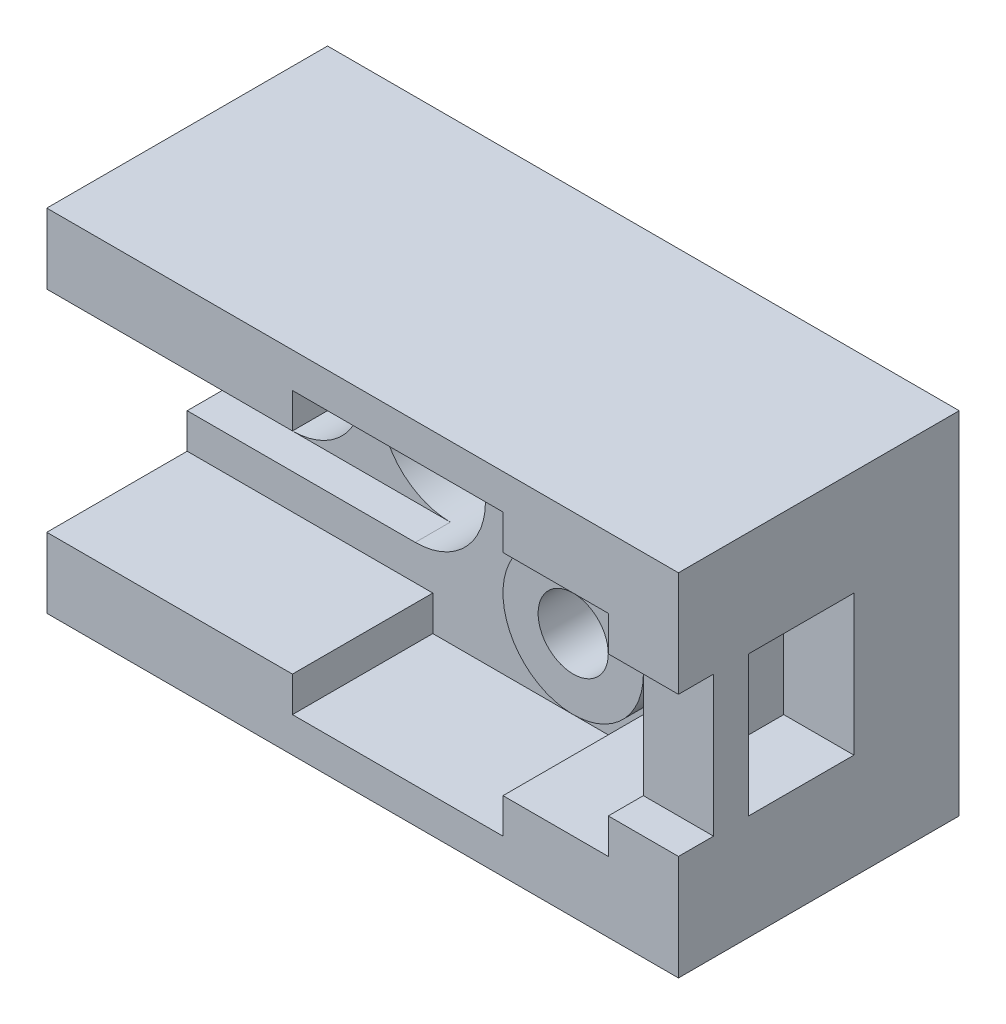
ISO-10303-21;
HEADER;
FILE_DESCRIPTION(('STEP AP214'),'2;1');
FILE_NAME('part.step','',(''),(''),'','','');
FILE_SCHEMA(('AUTOMOTIVE_DESIGN { 1 0 10303 214 1 1 1 1 }'));
ENDSEC;
DATA;
#1=APPLICATION_CONTEXT('core data for automotive mechanical design processes');
#2=APPLICATION_PROTOCOL_DEFINITION('international standard','automotive_design',2000,#1);
#3=PRODUCT_CONTEXT('',#1,'mechanical');
#4=PRODUCT('Part','Part','',(#3));
#5=PRODUCT_RELATED_PRODUCT_CATEGORY('part','',(#4));
#6=PRODUCT_DEFINITION_FORMATION('','',#4);
#7=PRODUCT_DEFINITION_CONTEXT('part definition',#1,'design');
#8=PRODUCT_DEFINITION('design','',#6,#7);
#9=PRODUCT_DEFINITION_SHAPE('','',#8);
#10=(LENGTH_UNIT() NAMED_UNIT(*) SI_UNIT(.MILLI.,.METRE.));
#11=(NAMED_UNIT(*) PLANE_ANGLE_UNIT() SI_UNIT($,.RADIAN.));
#12=(NAMED_UNIT(*) SI_UNIT($,.STERADIAN.) SOLID_ANGLE_UNIT());
#13=UNCERTAINTY_MEASURE_WITH_UNIT(LENGTH_MEASURE(1.E-05),#10,'distance_accuracy_value','');
#14=(GEOMETRIC_REPRESENTATION_CONTEXT(3) GLOBAL_UNCERTAINTY_ASSIGNED_CONTEXT((#13)) GLOBAL_UNIT_ASSIGNED_CONTEXT((#10,
#11,#12)) REPRESENTATION_CONTEXT('',''));
#15=CARTESIAN_POINT('',(0.,0.,0.));
#16=DIRECTION('',(0.,0.,1.));
#17=DIRECTION('',(1.,0.,0.));
#18=AXIS2_PLACEMENT_3D('',#15,#16,#17);
#19=CARTESIAN_POINT('',(0.,30.,0.));
#20=DIRECTION('',(0.,-1.,0.));
#21=DIRECTION('',(0.,0.,-1.));
#22=AXIS2_PLACEMENT_3D('',#19,#20,#21);
#23=PLANE('',#22);
#24=DIRECTION('',(0.,0.,-1.));
#25=VECTOR('',#24,1.);
#26=CARTESIAN_POINT('',(180.,30.,80.));
#27=LINE('',#26,#25);
#28=CARTESIAN_POINT('',(180.,30.,80.));
#29=VERTEX_POINT('',#28);
#30=CARTESIAN_POINT('',(180.,30.,70.));
#31=VERTEX_POINT('',#30);
#32=EDGE_CURVE('E56',#29,#31,#27,.T.);
#33=ORIENTED_EDGE('',*,*,#32,.T.);
#34=DIRECTION('',(-1.,0.,0.));
#35=VECTOR('',#34,1.);
#36=CARTESIAN_POINT('',(180.,30.,70.));
#37=LINE('',#36,#35);
#38=CARTESIAN_POINT('',(160.,30.,70.));
#39=VERTEX_POINT('',#38);
#40=EDGE_CURVE('E390',#31,#39,#37,.T.);
#41=ORIENTED_EDGE('',*,*,#40,.T.);
#42=DIRECTION('',(0.,0.,1.));
#43=VECTOR('',#42,1.);
#44=CARTESIAN_POINT('',(160.,30.,70.));
#45=LINE('',#44,#43);
#46=CARTESIAN_POINT('',(160.,30.,80.));
#47=VERTEX_POINT('',#46);
#48=EDGE_CURVE('E489',#39,#47,#45,.T.);
#49=ORIENTED_EDGE('',*,*,#48,.T.);
#50=DIRECTION('',(1.,0.,0.));
#51=VECTOR('',#50,1.);
#52=CARTESIAN_POINT('',(0.,30.,80.));
#53=LINE('',#52,#51);
#54=EDGE_CURVE('E293',#47,#29,#53,.T.);
#55=ORIENTED_EDGE('',*,*,#54,.T.);
#56=EDGE_LOOP('',(#33,#41,#49,#55));
#57=FACE_BOUND('',#56,.T.);
#58=ADVANCED_FACE('F33',(#57),#23,.F.);
#59=CARTESIAN_POINT('',(0.,70.,0.));
#60=DIRECTION('',(0.,1.,0.));
#61=DIRECTION('',(0.,0.,1.));
#62=AXIS2_PLACEMENT_3D('',#59,#60,#61);
#63=PLANE('',#62);
#64=DIRECTION('',(0.,0.,1.));
#65=VECTOR('',#64,1.);
#66=CARTESIAN_POINT('',(160.,70.,70.));
#67=LINE('',#66,#65);
#68=CARTESIAN_POINT('',(160.,70.,70.));
#69=VERTEX_POINT('',#68);
#70=CARTESIAN_POINT('',(160.,70.,80.));
#71=VERTEX_POINT('',#70);
#72=EDGE_CURVE('E386',#69,#71,#67,.T.);
#73=ORIENTED_EDGE('',*,*,#72,.F.);
#74=DIRECTION('',(-1.,0.,0.));
#75=VECTOR('',#74,1.);
#76=CARTESIAN_POINT('',(180.,70.,70.));
#77=LINE('',#76,#75);
#78=CARTESIAN_POINT('',(180.,70.,70.));
#79=VERTEX_POINT('',#78);
#80=EDGE_CURVE('E385',#79,#69,#77,.T.);
#81=ORIENTED_EDGE('',*,*,#80,.F.);
#82=DIRECTION('',(0.,0.,1.));
#83=VECTOR('',#82,1.);
#84=CARTESIAN_POINT('',(180.,70.,80.));
#85=LINE('',#84,#83);
#86=CARTESIAN_POINT('',(180.,70.,80.));
#87=VERTEX_POINT('',#86);
#88=EDGE_CURVE('E262',#79,#87,#85,.T.);
#89=ORIENTED_EDGE('',*,*,#88,.T.);
#90=DIRECTION('',(-1.,0.,0.));
#91=VECTOR('',#90,1.);
#92=CARTESIAN_POINT('',(0.,70.,80.));
#93=LINE('',#92,#91);
#94=EDGE_CURVE('E298',#87,#71,#93,.T.);
#95=ORIENTED_EDGE('',*,*,#94,.T.);
#96=EDGE_LOOP('',(#73,#81,#89,#95));
#97=FACE_BOUND('',#96,.T.);
#98=ADVANCED_FACE('F383',(#97),#63,.F.);
#99=DIRECTION('',(-1.,0.,0.));
#100=VECTOR('',#99,1.);
#101=CARTESIAN_POINT('',(0.,30.,40.));
#102=LINE('',#101,#100);
#103=CARTESIAN_POINT('',(65.,30.,40.));
#104=VERTEX_POINT('',#103);
#105=CARTESIAN_POINT('',(0.,30.,40.));
#106=VERTEX_POINT('',#105);
#107=EDGE_CURVE('E440',#104,#106,#102,.T.);
#108=ORIENTED_EDGE('',*,*,#107,.F.);
#109=DIRECTION('',(0.,0.,1.));
#110=VECTOR('',#109,1.);
#111=CARTESIAN_POINT('',(65.,30.,30.));
#112=LINE('',#111,#110);
#113=CARTESIAN_POINT('',(65.,30.,30.));
#114=VERTEX_POINT('',#113);
#115=EDGE_CURVE('E275',#114,#104,#112,.T.);
#116=ORIENTED_EDGE('',*,*,#115,.F.);
#117=DIRECTION('',(1.,0.,0.));
#118=VECTOR('',#117,1.);
#119=CARTESIAN_POINT('',(20.,30.,30.));
#120=LINE('',#119,#118);
#121=CARTESIAN_POINT('',(20.,30.,30.));
#122=VERTEX_POINT('',#121);
#123=EDGE_CURVE('E265',#122,#114,#120,.T.);
#124=ORIENTED_EDGE('',*,*,#123,.F.);
#125=DIRECTION('',(0.,0.,1.));
#126=VECTOR('',#125,1.);
#127=CARTESIAN_POINT('',(20.,30.,0.));
#128=LINE('',#127,#126);
#129=CARTESIAN_POINT('',(20.,30.,0.));
#130=VERTEX_POINT('',#129);
#131=EDGE_CURVE('E315',#130,#122,#128,.T.);
#132=ORIENTED_EDGE('',*,*,#131,.F.);
#133=DIRECTION('',(1.,0.,0.));
#134=VECTOR('',#133,1.);
#135=CARTESIAN_POINT('',(0.,30.,0.));
#136=LINE('',#135,#134);
#137=CARTESIAN_POINT('',(0.,30.,0.));
#138=VERTEX_POINT('',#137);
#139=EDGE_CURVE('E294',#138,#130,#136,.T.);
#140=ORIENTED_EDGE('',*,*,#139,.F.);
#141=DIRECTION('',(0.,0.,1.));
#142=VECTOR('',#141,1.);
#143=CARTESIAN_POINT('',(0.,30.,0.));
#144=LINE('',#143,#142);
#145=EDGE_CURVE('E304',#138,#106,#144,.T.);
#146=ORIENTED_EDGE('',*,*,#145,.T.);
#147=EDGE_LOOP('',(#108,#116,#124,#132,#140,#146));
#148=FACE_BOUND('',#147,.T.);
#149=ADVANCED_FACE('F561',(#148),#23,.F.);
#150=DIRECTION('',(1.,0.,0.));
#151=VECTOR('',#150,1.);
#152=CARTESIAN_POINT('',(0.,70.,40.));
#153=LINE('',#152,#151);
#154=CARTESIAN_POINT('',(0.,70.,40.));
#155=VERTEX_POINT('',#154);
#156=CARTESIAN_POINT('',(65.,70.,40.));
#157=VERTEX_POINT('',#156);
#158=EDGE_CURVE('E436',#155,#157,#153,.T.);
#159=ORIENTED_EDGE('',*,*,#158,.F.);
#160=DIRECTION('',(0.,0.,1.));
#161=VECTOR('',#160,1.);
#162=CARTESIAN_POINT('',(0.,70.,0.));
#163=LINE('',#162,#161);
#164=CARTESIAN_POINT('',(0.,70.,0.));
#165=VERTEX_POINT('',#164);
#166=EDGE_CURVE('E308',#165,#155,#163,.T.);
#167=ORIENTED_EDGE('',*,*,#166,.F.);
#168=DIRECTION('',(-1.,0.,0.));
#169=VECTOR('',#168,1.);
#170=CARTESIAN_POINT('',(0.,70.,0.));
#171=LINE('',#170,#169);
#172=CARTESIAN_POINT('',(20.,70.,0.));
#173=VERTEX_POINT('',#172);
#174=EDGE_CURVE('E301',#173,#165,#171,.T.);
#175=ORIENTED_EDGE('',*,*,#174,.F.);
#176=DIRECTION('',(0.,0.,1.));
#177=VECTOR('',#176,1.);
#178=CARTESIAN_POINT('',(20.,70.,0.));
#179=LINE('',#178,#177);
#180=CARTESIAN_POINT('',(19.9999999999999,70.,30.));
#181=VERTEX_POINT('',#180);
#182=EDGE_CURVE('E312',#173,#181,#179,.T.);
#183=ORIENTED_EDGE('',*,*,#182,.T.);
#184=DIRECTION('',(-1.,0.,0.));
#185=VECTOR('',#184,1.);
#186=CARTESIAN_POINT('',(19.9999999999999,70.,30.));
#187=LINE('',#186,#185);
#188=CARTESIAN_POINT('',(65.,70.,30.));
#189=VERTEX_POINT('',#188);
#190=EDGE_CURVE('E273',#189,#181,#187,.T.);
#191=ORIENTED_EDGE('',*,*,#190,.F.);
#192=DIRECTION('',(0.,0.,1.));
#193=VECTOR('',#192,1.);
#194=CARTESIAN_POINT('',(65.,70.,30.));
#195=LINE('',#194,#193);
#196=EDGE_CURVE('E276',#189,#157,#195,.T.);
#197=ORIENTED_EDGE('',*,*,#196,.T.);
#198=EDGE_LOOP('',(#159,#167,#175,#183,#191,#197));
#199=FACE_BOUND('',#198,.T.);
#200=ADVANCED_FACE('F570',(#199),#63,.F.);
#201=CARTESIAN_POINT('',(65.,50.,20.));
#202=DIRECTION('',(0.,0.,1.));
#203=DIRECTION('',(1.,0.,0.));
#204=AXIS2_PLACEMENT_3D('',#201,#202,#203);
#205=CYLINDRICAL_SURFACE('',#204,20.);
#206=CARTESIAN_POINT('',(65.,50.,20.));
#207=DIRECTION('',(0.,0.,1.));
#208=DIRECTION('',(1.,0.,0.));
#209=AXIS2_PLACEMENT_3D('',#206,#207,#208);
#210=CIRCLE('',#209,20.);
#211=CARTESIAN_POINT('',(85.,50.,20.));
#212=VERTEX_POINT('',#211);
#213=EDGE_CURVE('E279',#212,#212,#210,.T.);
#214=ORIENTED_EDGE('',*,*,#213,.F.);
#215=EDGE_LOOP('',(#214));
#216=FACE_BOUND('',#215,.T.);
#217=CARTESIAN_POINT('',(65.,50.,40.));
#218=DIRECTION('',(0.,0.,1.));
#219=DIRECTION('',(1.,0.,0.));
#220=AXIS2_PLACEMENT_3D('',#217,#218,#219);
#221=CIRCLE('',#220,20.);
#222=EDGE_CURVE('E438',#157,#104,#221,.F.);
#223=ORIENTED_EDGE('',*,*,#222,.F.);
#224=ORIENTED_EDGE('',*,*,#196,.F.);
#225=CARTESIAN_POINT('',(65.,50.,30.));
#226=DIRECTION('',(0.,0.,-1.));
#227=DIRECTION('',(1.,0.,0.));
#228=AXIS2_PLACEMENT_3D('',#225,#226,#227);
#229=CIRCLE('',#228,20.);
#230=EDGE_CURVE('E271',#114,#189,#229,.T.);
#231=ORIENTED_EDGE('',*,*,#230,.F.);
#232=ORIENTED_EDGE('',*,*,#115,.T.);
#233=EDGE_LOOP('',(#223,#224,#231,#232));
#234=FACE_BOUND('',#233,.T.);
#235=ADVANCED_FACE('F668',(#216,#234),#205,.F.);
#236=CARTESIAN_POINT('',(0.,0.,80.));
#237=DIRECTION('',(1.,0.,0.));
#238=DIRECTION('',(0.,0.,-1.));
#239=AXIS2_PLACEMENT_3D('',#236,#237,#238);
#240=PLANE('',#239);
#241=DIRECTION('',(0.,0.,1.));
#242=VECTOR('',#241,1.);
#243=CARTESIAN_POINT('',(0.,20.,70.));
#244=LINE('',#243,#242);
#245=CARTESIAN_POINT('',(0.,20.,40.));
#246=VERTEX_POINT('',#245);
#247=CARTESIAN_POINT('',(0.,20.,80.));
#248=VERTEX_POINT('',#247);
#249=EDGE_CURVE('E485',#246,#248,#244,.T.);
#250=ORIENTED_EDGE('',*,*,#249,.F.);
#251=DIRECTION('',(0.,-1.,0.));
#252=VECTOR('',#251,1.);
#253=CARTESIAN_POINT('',(0.,0.,40.));
#254=LINE('',#253,#252);
#255=EDGE_CURVE('E442',#106,#246,#254,.T.);
#256=ORIENTED_EDGE('',*,*,#255,.F.);
#257=ORIENTED_EDGE('',*,*,#145,.F.);
#258=DIRECTION('',(0.,-1.,0.));
#259=VECTOR('',#258,1.);
#260=CARTESIAN_POINT('',(0.,0.,0.));
#261=LINE('',#260,#259);
#262=CARTESIAN_POINT('',(0.,0.,0.));
#263=VERTEX_POINT('',#262);
#264=EDGE_CURVE('E311',#138,#263,#261,.T.);
#265=ORIENTED_EDGE('',*,*,#264,.T.);
#266=DIRECTION('',(0.,0.,-1.));
#267=VECTOR('',#266,1.);
#268=CARTESIAN_POINT('',(0.,0.,80.));
#269=LINE('',#268,#267);
#270=CARTESIAN_POINT('',(0.,0.,80.));
#271=VERTEX_POINT('',#270);
#272=EDGE_CURVE('E11',#271,#263,#269,.T.);
#273=ORIENTED_EDGE('',*,*,#272,.F.);
#274=DIRECTION('',(0.,-1.,0.));
#275=VECTOR('',#274,1.);
#276=CARTESIAN_POINT('',(0.,0.,80.));
#277=LINE('',#276,#275);
#278=EDGE_CURVE('E324',#248,#271,#277,.T.);
#279=ORIENTED_EDGE('',*,*,#278,.F.);
#280=EDGE_LOOP('',(#250,#256,#257,#265,#273,#279));
#281=FACE_BOUND('',#280,.T.);
#282=ADVANCED_FACE('F35',(#281),#240,.F.);
#283=CARTESIAN_POINT('',(0.,0.,80.));
#284=DIRECTION('',(0.,0.,-1.));
#285=DIRECTION('',(-1.,0.,0.));
#286=AXIS2_PLACEMENT_3D('',#283,#284,#285);
#287=PLANE('',#286);
#288=DIRECTION('',(-1.,0.,0.));
#289=VECTOR('',#288,1.);
#290=CARTESIAN_POINT('',(0.,20.,80.));
#291=LINE('',#290,#289);
#292=CARTESIAN_POINT('',(70.,20.,80.));
#293=VERTEX_POINT('',#292);
#294=EDGE_CURVE('E466',#293,#248,#291,.T.);
#295=ORIENTED_EDGE('',*,*,#294,.T.);
#296=ORIENTED_EDGE('',*,*,#278,.T.);
#297=DIRECTION('',(1.,0.,0.));
#298=VECTOR('',#297,1.);
#299=CARTESIAN_POINT('',(0.,0.,80.));
#300=LINE('',#299,#298);
#301=CARTESIAN_POINT('',(180.,0.,80.));
#302=VERTEX_POINT('',#301);
#303=EDGE_CURVE('E323',#271,#302,#300,.T.);
#304=ORIENTED_EDGE('',*,*,#303,.T.);
#305=DIRECTION('',(0.,1.,0.));
#306=VECTOR('',#305,1.);
#307=CARTESIAN_POINT('',(180.,0.,80.));
#308=LINE('',#307,#306);
#309=EDGE_CURVE('E327',#302,#29,#308,.T.);
#310=ORIENTED_EDGE('',*,*,#309,.T.);
#311=ORIENTED_EDGE('',*,*,#54,.F.);
#312=DIRECTION('',(0.,-1.,0.));
#313=VECTOR('',#312,1.);
#314=CARTESIAN_POINT('',(160.,0.,80.));
#315=LINE('',#314,#313);
#316=CARTESIAN_POINT('',(160.,20.,80.));
#317=VERTEX_POINT('',#316);
#318=EDGE_CURVE('E481',#47,#317,#315,.T.);
#319=ORIENTED_EDGE('',*,*,#318,.T.);
#320=DIRECTION('',(-1.,0.,0.));
#321=VECTOR('',#320,1.);
#322=CARTESIAN_POINT('',(0.,20.,80.));
#323=LINE('',#322,#321);
#324=CARTESIAN_POINT('',(130.,20.,80.));
#325=VERTEX_POINT('',#324);
#326=EDGE_CURVE('E478',#317,#325,#323,.T.);
#327=ORIENTED_EDGE('',*,*,#326,.T.);
#328=DIRECTION('',(0.,-1.,0.));
#329=VECTOR('',#328,1.);
#330=CARTESIAN_POINT('',(130.,0.,80.));
#331=LINE('',#330,#329);
#332=CARTESIAN_POINT('',(130.,10.,80.));
#333=VERTEX_POINT('',#332);
#334=EDGE_CURVE('E475',#325,#333,#331,.T.);
#335=ORIENTED_EDGE('',*,*,#334,.T.);
#336=DIRECTION('',(-1.,0.,0.));
#337=VECTOR('',#336,1.);
#338=CARTESIAN_POINT('',(0.,9.99999999999999,80.));
#339=LINE('',#338,#337);
#340=CARTESIAN_POINT('',(70.,10.,80.));
#341=VERTEX_POINT('',#340);
#342=EDGE_CURVE('E472',#333,#341,#339,.T.);
#343=ORIENTED_EDGE('',*,*,#342,.T.);
#344=DIRECTION('',(0.,1.,0.));
#345=VECTOR('',#344,1.);
#346=CARTESIAN_POINT('',(70.,0.,80.));
#347=LINE('',#346,#345);
#348=EDGE_CURVE('E469',#341,#293,#347,.T.);
#349=ORIENTED_EDGE('',*,*,#348,.T.);
#350=EDGE_LOOP('',(#295,#296,#304,#310,#311,#319,#327,#335,#343,#349));
#351=FACE_BOUND('',#350,.T.);
#352=ADVANCED_FACE('F551',(#351),#287,.F.);
#353=CARTESIAN_POINT('',(160.,30.,40.));
#354=VERTEX_POINT('',#353);
#355=CARTESIAN_POINT('',(160.,30.,60.));
#356=VERTEX_POINT('',#355);
#357=EDGE_CURVE('E487',#354,#356,#45,.T.);
#358=ORIENTED_EDGE('',*,*,#357,.T.);
#359=DIRECTION('',(-1.,0.,0.));
#360=VECTOR('',#359,1.);
#361=CARTESIAN_POINT('',(180.,30.,60.));
#362=LINE('',#361,#360);
#363=CARTESIAN_POINT('',(180.,30.,60.));
#364=VERTEX_POINT('',#363);
#365=EDGE_CURVE('E48',#364,#356,#362,.T.);
#366=ORIENTED_EDGE('',*,*,#365,.F.);
#367=CARTESIAN_POINT('',(180.,30.,30.));
#368=VERTEX_POINT('',#367);
#369=EDGE_CURVE('E254',#364,#368,#27,.T.);
#370=ORIENTED_EDGE('',*,*,#369,.T.);
#371=DIRECTION('',(1.,0.,0.));
#372=VECTOR('',#371,1.);
#373=CARTESIAN_POINT('',(180.,30.,30.));
#374=LINE('',#373,#372);
#375=CARTESIAN_POINT('',(160.,30.,30.));
#376=VERTEX_POINT('',#375);
#377=EDGE_CURVE('E405',#376,#368,#374,.T.);
#378=ORIENTED_EDGE('',*,*,#377,.F.);
#379=DIRECTION('',(0.,0.,1.));
#380=VECTOR('',#379,1.);
#381=CARTESIAN_POINT('',(160.,30.,30.));
#382=LINE('',#381,#380);
#383=EDGE_CURVE('E409',#376,#354,#382,.T.);
#384=ORIENTED_EDGE('',*,*,#383,.T.);
#385=EDGE_LOOP('',(#358,#366,#370,#378,#384));
#386=FACE_BOUND('',#385,.T.);
#387=ADVANCED_FACE('F593',(#386),#23,.F.);
#388=DIRECTION('',(1.,0.,0.));
#389=VECTOR('',#388,1.);
#390=CARTESIAN_POINT('',(0.,80.,80.));
#391=LINE('',#390,#389);
#392=CARTESIAN_POINT('',(0.,80.,80.));
#393=VERTEX_POINT('',#392);
#394=CARTESIAN_POINT('',(70.,80.,80.));
#395=VERTEX_POINT('',#394);
#396=EDGE_CURVE('E375',#393,#395,#391,.T.);
#397=ORIENTED_EDGE('',*,*,#396,.T.);
#398=DIRECTION('',(0.,-1.,0.));
#399=VECTOR('',#398,1.);
#400=CARTESIAN_POINT('',(70.,0.,80.));
#401=LINE('',#400,#399);
#402=CARTESIAN_POINT('',(70.,90.,80.));
#403=VERTEX_POINT('',#402);
#404=EDGE_CURVE('E512',#403,#395,#401,.T.);
#405=ORIENTED_EDGE('',*,*,#404,.F.);
#406=DIRECTION('',(-1.,0.,0.));
#407=VECTOR('',#406,1.);
#408=CARTESIAN_POINT('',(0.,90.,80.));
#409=LINE('',#408,#407);
#410=CARTESIAN_POINT('',(130.,90.,80.));
#411=VERTEX_POINT('',#410);
#412=EDGE_CURVE('E509',#411,#403,#409,.T.);
#413=ORIENTED_EDGE('',*,*,#412,.F.);
#414=DIRECTION('',(0.,1.,0.));
#415=VECTOR('',#414,1.);
#416=CARTESIAN_POINT('',(130.,0.,80.));
#417=LINE('',#416,#415);
#418=CARTESIAN_POINT('',(130.,80.,80.));
#419=VERTEX_POINT('',#418);
#420=EDGE_CURVE('E506',#419,#411,#417,.T.);
#421=ORIENTED_EDGE('',*,*,#420,.F.);
#422=DIRECTION('',(-1.,0.,0.));
#423=VECTOR('',#422,1.);
#424=CARTESIAN_POINT('',(0.,79.9999999999999,80.));
#425=LINE('',#424,#423);
#426=CARTESIAN_POINT('',(160.,80.,80.));
#427=VERTEX_POINT('',#426);
#428=EDGE_CURVE('E503',#427,#419,#425,.T.);
#429=ORIENTED_EDGE('',*,*,#428,.F.);
#430=DIRECTION('',(0.,1.,0.));
#431=VECTOR('',#430,1.);
#432=CARTESIAN_POINT('',(160.,0.,80.));
#433=LINE('',#432,#431);
#434=EDGE_CURVE('E500',#71,#427,#433,.T.);
#435=ORIENTED_EDGE('',*,*,#434,.F.);
#436=ORIENTED_EDGE('',*,*,#94,.F.);
#437=CARTESIAN_POINT('',(180.,100.,80.));
#438=VERTEX_POINT('',#437);
#439=EDGE_CURVE('E326',#87,#438,#308,.T.);
#440=ORIENTED_EDGE('',*,*,#439,.T.);
#441=DIRECTION('',(-1.,0.,0.));
#442=VECTOR('',#441,1.);
#443=CARTESIAN_POINT('',(0.,100.,80.));
#444=LINE('',#443,#442);
#445=CARTESIAN_POINT('',(0.,100.,80.));
#446=VERTEX_POINT('',#445);
#447=EDGE_CURVE('E330',#438,#446,#444,.T.);
#448=ORIENTED_EDGE('',*,*,#447,.T.);
#449=EDGE_CURVE('E320',#446,#393,#277,.T.);
#450=ORIENTED_EDGE('',*,*,#449,.T.);
#451=EDGE_LOOP('',(#397,#405,#413,#421,#429,#435,#436,#440,#448,#450));
#452=FACE_BOUND('',#451,.T.);
#453=ADVANCED_FACE('F373',(#452),#287,.F.);
#454=DIRECTION('',(0.,-1.,0.));
#455=VECTOR('',#454,1.);
#456=CARTESIAN_POINT('',(0.,0.,40.));
#457=LINE('',#456,#455);
#458=CARTESIAN_POINT('',(0.,80.,40.));
#459=VERTEX_POINT('',#458);
#460=EDGE_CURVE('E434',#459,#155,#457,.T.);
#461=ORIENTED_EDGE('',*,*,#460,.F.);
#462=DIRECTION('',(0.,0.,1.));
#463=VECTOR('',#462,1.);
#464=CARTESIAN_POINT('',(0.,80.,70.));
#465=LINE('',#464,#463);
#466=EDGE_CURVE('E370',#459,#393,#465,.T.);
#467=ORIENTED_EDGE('',*,*,#466,.T.);
#468=ORIENTED_EDGE('',*,*,#449,.F.);
#469=DIRECTION('',(0.,0.,-1.));
#470=VECTOR('',#469,1.);
#471=CARTESIAN_POINT('',(0.,100.,80.));
#472=LINE('',#471,#470);
#473=CARTESIAN_POINT('',(0.,100.,0.));
#474=VERTEX_POINT('',#473);
#475=EDGE_CURVE('E332',#446,#474,#472,.T.);
#476=ORIENTED_EDGE('',*,*,#475,.T.);
#477=EDGE_CURVE('E333',#474,#165,#261,.T.);
#478=ORIENTED_EDGE('',*,*,#477,.T.);
#479=ORIENTED_EDGE('',*,*,#166,.T.);
#480=EDGE_LOOP('',(#461,#467,#468,#476,#478,#479));
#481=FACE_BOUND('',#480,.T.);
#482=ADVANCED_FACE('F368',(#481),#240,.F.);
#483=CARTESIAN_POINT('',(130.,50.,60.));
#484=DIRECTION('',(0.,0.,-1.));
#485=DIRECTION('',(-1.,0.,0.));
#486=AXIS2_PLACEMENT_3D('',#483,#484,#485);
#487=CYLINDRICAL_SURFACE('',#486,9.99999999999999);
#488=CARTESIAN_POINT('',(130.,50.,0.));
#489=DIRECTION('',(0.,0.,-1.));
#490=DIRECTION('',(-1.,0.,0.));
#491=AXIS2_PLACEMENT_3D('',#488,#489,#490);
#492=CIRCLE('',#491,9.99999999999999);
#493=CARTESIAN_POINT('',(120.,50.,0.));
#494=VERTEX_POINT('',#493);
#495=EDGE_CURVE('E287',#494,#494,#492,.T.);
#496=ORIENTED_EDGE('',*,*,#495,.T.);
#497=EDGE_LOOP('',(#496));
#498=FACE_BOUND('',#497,.T.);
#499=CARTESIAN_POINT('',(130.,50.,60.));
#500=DIRECTION('',(0.,0.,1.));
#501=DIRECTION('',(1.,0.,0.));
#502=AXIS2_PLACEMENT_3D('',#499,#500,#501);
#503=CIRCLE('',#502,10.);
#504=CARTESIAN_POINT('',(140.,50.,60.));
#505=VERTEX_POINT('',#504);
#506=EDGE_CURVE('E463',#505,#505,#503,.T.);
#507=ORIENTED_EDGE('',*,*,#506,.T.);
#508=EDGE_LOOP('',(#507));
#509=FACE_BOUND('',#508,.T.);
#510=ADVANCED_FACE('F672',(#498,#509),#487,.F.);
#511=CARTESIAN_POINT('',(0.,0.,80.));
#512=DIRECTION('',(0.,1.,0.));
#513=DIRECTION('',(0.,0.,1.));
#514=AXIS2_PLACEMENT_3D('',#511,#512,#513);
#515=PLANE('',#514);
#516=DIRECTION('',(1.,0.,0.));
#517=VECTOR('',#516,1.);
#518=CARTESIAN_POINT('',(0.,0.,0.));
#519=LINE('',#518,#517);
#520=CARTESIAN_POINT('',(180.,0.,0.));
#521=VERTEX_POINT('',#520);
#522=EDGE_CURVE('E336',#263,#521,#519,.T.);
#523=ORIENTED_EDGE('',*,*,#522,.T.);
#524=DIRECTION('',(0.,0.,-1.));
#525=VECTOR('',#524,1.);
#526=CARTESIAN_POINT('',(180.,0.,80.));
#527=LINE('',#526,#525);
#528=EDGE_CURVE('E41',#302,#521,#527,.T.);
#529=ORIENTED_EDGE('',*,*,#528,.F.);
#530=ORIENTED_EDGE('',*,*,#303,.F.);
#531=ORIENTED_EDGE('',*,*,#272,.T.);
#532=EDGE_LOOP('',(#523,#529,#530,#531));
#533=FACE_BOUND('',#532,.T.);
#534=ADVANCED_FACE('F554',(#533),#515,.F.);
#535=CARTESIAN_POINT('',(180.,0.,80.));
#536=DIRECTION('',(-1.,0.,0.));
#537=DIRECTION('',(0.,0.,1.));
#538=AXIS2_PLACEMENT_3D('',#535,#536,#537);
#539=PLANE('',#538);
#540=DIRECTION('',(0.,1.,0.));
#541=VECTOR('',#540,1.);
#542=CARTESIAN_POINT('',(180.,70.,70.));
#543=LINE('',#542,#541);
#544=EDGE_CURVE('E247',#31,#79,#543,.T.);
#545=ORIENTED_EDGE('',*,*,#544,.F.);
#546=ORIENTED_EDGE('',*,*,#32,.F.);
#547=ORIENTED_EDGE('',*,*,#309,.F.);
#548=ORIENTED_EDGE('',*,*,#528,.T.);
#549=DIRECTION('',(0.,1.,0.));
#550=VECTOR('',#549,1.);
#551=CARTESIAN_POINT('',(180.,0.,0.));
#552=LINE('',#551,#550);
#553=CARTESIAN_POINT('',(180.,100.,0.));
#554=VERTEX_POINT('',#553);
#555=EDGE_CURVE('E338',#521,#554,#552,.T.);
#556=ORIENTED_EDGE('',*,*,#555,.T.);
#557=DIRECTION('',(0.,0.,-1.));
#558=VECTOR('',#557,1.);
#559=CARTESIAN_POINT('',(180.,100.,80.));
#560=LINE('',#559,#558);
#561=EDGE_CURVE('E344',#438,#554,#560,.T.);
#562=ORIENTED_EDGE('',*,*,#561,.F.);
#563=ORIENTED_EDGE('',*,*,#439,.F.);
#564=ORIENTED_EDGE('',*,*,#88,.F.);
#565=EDGE_LOOP('',(#545,#546,#547,#548,#556,#562,#563,#564));
#566=FACE_BOUND('',#565,.T.);
#567=DIRECTION('',(0.,1.,0.));
#568=VECTOR('',#567,1.);
#569=CARTESIAN_POINT('',(180.,70.,30.));
#570=LINE('',#569,#568);
#571=CARTESIAN_POINT('',(180.,70.,30.));
#572=VERTEX_POINT('',#571);
#573=EDGE_CURVE('E393',#368,#572,#570,.T.);
#574=ORIENTED_EDGE('',*,*,#573,.F.);
#575=ORIENTED_EDGE('',*,*,#369,.F.);
#576=DIRECTION('',(0.,-1.,0.));
#577=VECTOR('',#576,1.);
#578=CARTESIAN_POINT('',(180.,30.,60.));
#579=LINE('',#578,#577);
#580=CARTESIAN_POINT('',(180.,70.,60.));
#581=VERTEX_POINT('',#580);
#582=EDGE_CURVE('E240',#581,#364,#579,.T.);
#583=ORIENTED_EDGE('',*,*,#582,.F.);
#584=EDGE_CURVE('E252',#572,#581,#85,.T.);
#585=ORIENTED_EDGE('',*,*,#584,.F.);
#586=EDGE_LOOP('',(#574,#575,#583,#585));
#587=FACE_BOUND('',#586,.T.);
#588=ADVANCED_FACE('F251',(#566,#587),#539,.F.);
#589=CARTESIAN_POINT('',(0.,100.,80.));
#590=DIRECTION('',(0.,-1.,0.));
#591=DIRECTION('',(0.,0.,-1.));
#592=AXIS2_PLACEMENT_3D('',#589,#590,#591);
#593=PLANE('',#592);
#594=DIRECTION('',(-1.,0.,0.));
#595=VECTOR('',#594,1.);
#596=CARTESIAN_POINT('',(0.,100.,0.));
#597=LINE('',#596,#595);
#598=EDGE_CURVE('E340',#554,#474,#597,.T.);
#599=ORIENTED_EDGE('',*,*,#598,.T.);
#600=ORIENTED_EDGE('',*,*,#475,.F.);
#601=ORIENTED_EDGE('',*,*,#447,.F.);
#602=ORIENTED_EDGE('',*,*,#561,.T.);
#603=EDGE_LOOP('',(#599,#600,#601,#602));
#604=FACE_BOUND('',#603,.T.);
#605=ADVANCED_FACE('F363',(#604),#593,.F.);
#606=CARTESIAN_POINT('',(0.,0.,0.));
#607=DIRECTION('',(0.,0.,-1.));
#608=DIRECTION('',(-1.,0.,0.));
#609=AXIS2_PLACEMENT_3D('',#606,#607,#608);
#610=PLANE('',#609);
#611=ORIENTED_EDGE('',*,*,#495,.F.);
#612=EDGE_LOOP('',(#611));
#613=FACE_BOUND('',#612,.T.);
#614=CARTESIAN_POINT('',(65.,50.,0.));
#615=DIRECTION('',(0.,0.,-1.));
#616=DIRECTION('',(-1.,0.,0.));
#617=AXIS2_PLACEMENT_3D('',#614,#615,#616);
#618=CIRCLE('',#617,5.);
#619=CARTESIAN_POINT('',(60.,50.,0.));
#620=VERTEX_POINT('',#619);
#621=EDGE_CURVE('E290',#620,#620,#618,.T.);
#622=ORIENTED_EDGE('',*,*,#621,.F.);
#623=EDGE_LOOP('',(#622));
#624=FACE_BOUND('',#623,.T.);
#625=ORIENTED_EDGE('',*,*,#174,.T.);
#626=ORIENTED_EDGE('',*,*,#477,.F.);
#627=ORIENTED_EDGE('',*,*,#598,.F.);
#628=ORIENTED_EDGE('',*,*,#555,.F.);
#629=ORIENTED_EDGE('',*,*,#522,.F.);
#630=ORIENTED_EDGE('',*,*,#264,.F.);
#631=ORIENTED_EDGE('',*,*,#139,.T.);
#632=CARTESIAN_POINT('',(20.,50.,0.));
#633=DIRECTION('',(0.,0.,1.));
#634=DIRECTION('',(-1.,0.,0.));
#635=AXIS2_PLACEMENT_3D('',#632,#633,#634);
#636=CIRCLE('',#635,20.);
#637=EDGE_CURVE('E297',#130,#173,#636,.T.);
#638=ORIENTED_EDGE('',*,*,#637,.T.);
#639=EDGE_LOOP('',(#625,#626,#627,#628,#629,#630,#631,#638));
#640=FACE_BOUND('',#639,.T.);
#641=ADVANCED_FACE('F358',(#613,#624,#640),#610,.T.);
#642=ORIENTED_EDGE('',*,*,#584,.T.);
#643=DIRECTION('',(-1.,0.,0.));
#644=VECTOR('',#643,1.);
#645=CARTESIAN_POINT('',(180.,70.,60.));
#646=LINE('',#645,#644);
#647=CARTESIAN_POINT('',(160.,70.,60.));
#648=VERTEX_POINT('',#647);
#649=EDGE_CURVE('E237',#581,#648,#646,.T.);
#650=ORIENTED_EDGE('',*,*,#649,.T.);
#651=CARTESIAN_POINT('',(160.,70.,40.));
#652=VERTEX_POINT('',#651);
#653=EDGE_CURVE('E525',#652,#648,#67,.T.);
#654=ORIENTED_EDGE('',*,*,#653,.F.);
#655=DIRECTION('',(0.,0.,1.));
#656=VECTOR('',#655,1.);
#657=CARTESIAN_POINT('',(160.,70.,30.));
#658=LINE('',#657,#656);
#659=CARTESIAN_POINT('',(160.,70.,30.));
#660=VERTEX_POINT('',#659);
#661=EDGE_CURVE('E407',#660,#652,#658,.T.);
#662=ORIENTED_EDGE('',*,*,#661,.F.);
#663=DIRECTION('',(-1.,0.,0.));
#664=VECTOR('',#663,1.);
#665=CARTESIAN_POINT('',(180.,70.,30.));
#666=LINE('',#665,#664);
#667=EDGE_CURVE('E259',#572,#660,#666,.T.);
#668=ORIENTED_EDGE('',*,*,#667,.F.);
#669=EDGE_LOOP('',(#642,#650,#654,#662,#668));
#670=FACE_BOUND('',#669,.T.);
#671=ADVANCED_FACE('F257',(#670),#63,.F.);
#672=CARTESIAN_POINT('',(20.,50.,0.));
#673=DIRECTION('',(0.,0.,1.));
#674=DIRECTION('',(1.,0.,0.));
#675=AXIS2_PLACEMENT_3D('',#672,#673,#674);
#676=CYLINDRICAL_SURFACE('',#675,20.);
#677=ORIENTED_EDGE('',*,*,#131,.T.);
#678=CARTESIAN_POINT('',(19.9999999999999,50.,30.));
#679=DIRECTION('',(0.,0.,-1.));
#680=DIRECTION('',(-1.,0.,0.));
#681=AXIS2_PLACEMENT_3D('',#678,#679,#680);
#682=CIRCLE('',#681,20.);
#683=EDGE_CURVE('E261',#181,#122,#682,.T.);
#684=ORIENTED_EDGE('',*,*,#683,.F.);
#685=ORIENTED_EDGE('',*,*,#182,.F.);
#686=ORIENTED_EDGE('',*,*,#637,.F.);
#687=EDGE_LOOP('',(#677,#684,#685,#686));
#688=FACE_BOUND('',#687,.T.);
#689=ADVANCED_FACE('F565',(#688),#676,.F.);
#690=CARTESIAN_POINT('',(65.,50.,20.));
#691=DIRECTION('',(0.,0.,-1.));
#692=DIRECTION('',(-1.,0.,0.));
#693=AXIS2_PLACEMENT_3D('',#690,#691,#692);
#694=CYLINDRICAL_SURFACE('',#693,5.);
#695=CARTESIAN_POINT('',(65.,50.,20.));
#696=DIRECTION('',(0.,0.,1.));
#697=DIRECTION('',(1.,0.,0.));
#698=AXIS2_PLACEMENT_3D('',#695,#696,#697);
#699=CIRCLE('',#698,5.);
#700=CARTESIAN_POINT('',(70.,50.,20.));
#701=VERTEX_POINT('',#700);
#702=EDGE_CURVE('E284',#701,#701,#699,.F.);
#703=ORIENTED_EDGE('',*,*,#702,.F.);
#704=EDGE_LOOP('',(#703));
#705=FACE_BOUND('',#704,.T.);
#706=ORIENTED_EDGE('',*,*,#621,.T.);
#707=EDGE_LOOP('',(#706));
#708=FACE_BOUND('',#707,.T.);
#709=ADVANCED_FACE('F666',(#705,#708),#694,.F.);
#710=CARTESIAN_POINT('',(65.,50.,20.));
#711=DIRECTION('',(0.,0.,1.));
#712=DIRECTION('',(1.,0.,0.));
#713=AXIS2_PLACEMENT_3D('',#710,#711,#712);
#714=PLANE('',#713);
#715=ORIENTED_EDGE('',*,*,#213,.T.);
#716=EDGE_LOOP('',(#715));
#717=FACE_BOUND('',#716,.T.);
#718=ORIENTED_EDGE('',*,*,#702,.T.);
#719=EDGE_LOOP('',(#718));
#720=FACE_BOUND('',#719,.T.);
#721=ADVANCED_FACE('F659',(#717,#720),#714,.T.);
#722=CARTESIAN_POINT('',(19.9999999999999,50.,30.));
#723=DIRECTION('',(0.,0.,-1.));
#724=DIRECTION('',(-1.,0.,0.));
#725=AXIS2_PLACEMENT_3D('',#722,#723,#724);
#726=PLANE('',#725);
#727=ORIENTED_EDGE('',*,*,#683,.T.);
#728=ORIENTED_EDGE('',*,*,#123,.T.);
#729=ORIENTED_EDGE('',*,*,#230,.T.);
#730=ORIENTED_EDGE('',*,*,#190,.T.);
#731=EDGE_LOOP('',(#727,#728,#729,#730));
#732=FACE_BOUND('',#731,.T.);
#733=ADVANCED_FACE('F654',(#732),#726,.F.);
#734=CARTESIAN_POINT('',(0.,80.,70.));
#735=DIRECTION('',(0.,-1.,0.));
#736=DIRECTION('',(1.,0.,0.));
#737=AXIS2_PLACEMENT_3D('',#734,#735,#736);
#738=PLANE('',#737);
#739=ORIENTED_EDGE('',*,*,#396,.F.);
#740=ORIENTED_EDGE('',*,*,#466,.F.);
#741=DIRECTION('',(-1.,0.,0.));
#742=VECTOR('',#741,1.);
#743=CARTESIAN_POINT('',(0.,80.,40.));
#744=LINE('',#743,#742);
#745=CARTESIAN_POINT('',(70.,80.,40.));
#746=VERTEX_POINT('',#745);
#747=EDGE_CURVE('E431',#746,#459,#744,.T.);
#748=ORIENTED_EDGE('',*,*,#747,.F.);
#749=DIRECTION('',(0.,0.,1.));
#750=VECTOR('',#749,1.);
#751=CARTESIAN_POINT('',(70.,80.,70.));
#752=LINE('',#751,#750);
#753=EDGE_CURVE('E515',#746,#395,#752,.T.);
#754=ORIENTED_EDGE('',*,*,#753,.T.);
#755=EDGE_LOOP('',(#739,#740,#748,#754));
#756=FACE_BOUND('',#755,.T.);
#757=ADVANCED_FACE('F575',(#756),#738,.T.);
#758=CARTESIAN_POINT('',(70.,0.,70.));
#759=DIRECTION('',(-1.,0.,0.));
#760=DIRECTION('',(0.,0.,1.));
#761=AXIS2_PLACEMENT_3D('',#758,#759,#760);
#762=PLANE('',#761);
#763=ORIENTED_EDGE('',*,*,#404,.T.);
#764=ORIENTED_EDGE('',*,*,#753,.F.);
#765=DIRECTION('',(0.,-1.,0.));
#766=VECTOR('',#765,1.);
#767=CARTESIAN_POINT('',(70.,0.,40.));
#768=LINE('',#767,#766);
#769=CARTESIAN_POINT('',(70.,90.,40.));
#770=VERTEX_POINT('',#769);
#771=EDGE_CURVE('E428',#770,#746,#768,.T.);
#772=ORIENTED_EDGE('',*,*,#771,.F.);
#773=DIRECTION('',(0.,0.,1.));
#774=VECTOR('',#773,1.);
#775=CARTESIAN_POINT('',(70.,90.,70.));
#776=LINE('',#775,#774);
#777=EDGE_CURVE('E517',#770,#403,#776,.T.);
#778=ORIENTED_EDGE('',*,*,#777,.T.);
#779=EDGE_LOOP('',(#763,#764,#772,#778));
#780=FACE_BOUND('',#779,.T.);
#781=ADVANCED_FACE('F577',(#780),#762,.F.);
#782=CARTESIAN_POINT('',(0.,90.,70.));
#783=DIRECTION('',(0.,1.,0.));
#784=DIRECTION('',(-1.,0.,0.));
#785=AXIS2_PLACEMENT_3D('',#782,#783,#784);
#786=PLANE('',#785);
#787=ORIENTED_EDGE('',*,*,#412,.T.);
#788=ORIENTED_EDGE('',*,*,#777,.F.);
#789=DIRECTION('',(-1.,0.,0.));
#790=VECTOR('',#789,1.);
#791=CARTESIAN_POINT('',(0.,90.,40.));
#792=LINE('',#791,#790);
#793=CARTESIAN_POINT('',(130.,90.,40.));
#794=VERTEX_POINT('',#793);
#795=EDGE_CURVE('E425',#794,#770,#792,.T.);
#796=ORIENTED_EDGE('',*,*,#795,.F.);
#797=DIRECTION('',(0.,0.,1.));
#798=VECTOR('',#797,1.);
#799=CARTESIAN_POINT('',(130.,90.,70.));
#800=LINE('',#799,#798);
#801=EDGE_CURVE('E519',#794,#411,#800,.T.);
#802=ORIENTED_EDGE('',*,*,#801,.T.);
#803=EDGE_LOOP('',(#787,#788,#796,#802));
#804=FACE_BOUND('',#803,.T.);
#805=ADVANCED_FACE('F579',(#804),#786,.F.);
#806=CARTESIAN_POINT('',(130.,0.,70.));
#807=DIRECTION('',(1.,0.,0.));
#808=DIRECTION('',(0.,0.,-1.));
#809=AXIS2_PLACEMENT_3D('',#806,#807,#808);
#810=PLANE('',#809);
#811=ORIENTED_EDGE('',*,*,#420,.T.);
#812=ORIENTED_EDGE('',*,*,#801,.F.);
#813=DIRECTION('',(0.,1.,0.));
#814=VECTOR('',#813,1.);
#815=CARTESIAN_POINT('',(130.,0.,40.));
#816=LINE('',#815,#814);
#817=CARTESIAN_POINT('',(130.,80.,40.));
#818=VERTEX_POINT('',#817);
#819=EDGE_CURVE('E422',#818,#794,#816,.T.);
#820=ORIENTED_EDGE('',*,*,#819,.F.);
#821=DIRECTION('',(0.,0.,1.));
#822=VECTOR('',#821,1.);
#823=CARTESIAN_POINT('',(130.,80.,70.));
#824=LINE('',#823,#822);
#825=EDGE_CURVE('E521',#818,#419,#824,.T.);
#826=ORIENTED_EDGE('',*,*,#825,.T.);
#827=EDGE_LOOP('',(#811,#812,#820,#826));
#828=FACE_BOUND('',#827,.T.);
#829=ADVANCED_FACE('F582',(#828),#810,.F.);
#830=CARTESIAN_POINT('',(0.,79.9999999999999,70.));
#831=DIRECTION('',(0.,1.,0.));
#832=DIRECTION('',(-1.,0.,0.));
#833=AXIS2_PLACEMENT_3D('',#830,#831,#832);
#834=PLANE('',#833);
#835=ORIENTED_EDGE('',*,*,#428,.T.);
#836=ORIENTED_EDGE('',*,*,#825,.F.);
#837=DIRECTION('',(-1.,0.,0.));
#838=VECTOR('',#837,1.);
#839=CARTESIAN_POINT('',(0.,79.9999999999999,40.));
#840=LINE('',#839,#838);
#841=CARTESIAN_POINT('',(160.,80.,40.));
#842=VERTEX_POINT('',#841);
#843=EDGE_CURVE('E419',#842,#818,#840,.T.);
#844=ORIENTED_EDGE('',*,*,#843,.F.);
#845=DIRECTION('',(0.,0.,1.));
#846=VECTOR('',#845,1.);
#847=CARTESIAN_POINT('',(160.,80.,70.));
#848=LINE('',#847,#846);
#849=EDGE_CURVE('E523',#842,#427,#848,.T.);
#850=ORIENTED_EDGE('',*,*,#849,.T.);
#851=EDGE_LOOP('',(#835,#836,#844,#850));
#852=FACE_BOUND('',#851,.T.);
#853=ADVANCED_FACE('F532',(#852),#834,.F.);
#854=CARTESIAN_POINT('',(160.,0.,70.));
#855=DIRECTION('',(1.,0.,0.));
#856=DIRECTION('',(0.,0.,-1.));
#857=AXIS2_PLACEMENT_3D('',#854,#855,#856);
#858=PLANE('',#857);
#859=ORIENTED_EDGE('',*,*,#434,.T.);
#860=ORIENTED_EDGE('',*,*,#849,.F.);
#861=DIRECTION('',(0.,1.,0.));
#862=VECTOR('',#861,1.);
#863=CARTESIAN_POINT('',(160.,0.,40.));
#864=LINE('',#863,#862);
#865=EDGE_CURVE('E415',#652,#842,#864,.T.);
#866=ORIENTED_EDGE('',*,*,#865,.F.);
#867=ORIENTED_EDGE('',*,*,#653,.T.);
#868=DIRECTION('',(0.,-1.,0.));
#869=VECTOR('',#868,1.);
#870=CARTESIAN_POINT('',(160.,30.,60.));
#871=LINE('',#870,#869);
#872=EDGE_CURVE('E242',#648,#356,#871,.T.);
#873=ORIENTED_EDGE('',*,*,#872,.T.);
#874=ORIENTED_EDGE('',*,*,#357,.F.);
#875=CARTESIAN_POINT('',(160.,20.,40.));
#876=VERTEX_POINT('',#875);
#877=EDGE_CURVE('E416',#876,#354,#864,.T.);
#878=ORIENTED_EDGE('',*,*,#877,.F.);
#879=DIRECTION('',(0.,0.,1.));
#880=VECTOR('',#879,1.);
#881=CARTESIAN_POINT('',(160.,20.,70.));
#882=LINE('',#881,#880);
#883=EDGE_CURVE('E490',#876,#317,#882,.T.);
#884=ORIENTED_EDGE('',*,*,#883,.T.);
#885=ORIENTED_EDGE('',*,*,#318,.F.);
#886=ORIENTED_EDGE('',*,*,#48,.F.);
#887=DIRECTION('',(0.,1.,0.));
#888=VECTOR('',#887,1.);
#889=CARTESIAN_POINT('',(160.,70.,70.));
#890=LINE('',#889,#888);
#891=EDGE_CURVE('E255',#39,#69,#890,.T.);
#892=ORIENTED_EDGE('',*,*,#891,.T.);
#893=ORIENTED_EDGE('',*,*,#72,.T.);
#894=EDGE_LOOP('',(#859,#860,#866,#867,#873,#874,#878,#884,#885,#886,#892,#893));
#895=FACE_BOUND('',#894,.T.);
#896=ADVANCED_FACE('F527',(#895),#858,.F.);
#897=CARTESIAN_POINT('',(0.,20.,70.));
#898=DIRECTION('',(0.,1.,0.));
#899=DIRECTION('',(-1.,0.,0.));
#900=AXIS2_PLACEMENT_3D('',#897,#898,#899);
#901=PLANE('',#900);
#902=ORIENTED_EDGE('',*,*,#294,.F.);
#903=DIRECTION('',(0.,0.,1.));
#904=VECTOR('',#903,1.);
#905=CARTESIAN_POINT('',(70.,20.,70.));
#906=LINE('',#905,#904);
#907=CARTESIAN_POINT('',(70.,20.,40.));
#908=VERTEX_POINT('',#907);
#909=EDGE_CURVE('E484',#908,#293,#906,.T.);
#910=ORIENTED_EDGE('',*,*,#909,.F.);
#911=DIRECTION('',(1.,0.,0.));
#912=VECTOR('',#911,1.);
#913=CARTESIAN_POINT('',(0.,20.,40.));
#914=LINE('',#913,#912);
#915=EDGE_CURVE('E445',#246,#908,#914,.T.);
#916=ORIENTED_EDGE('',*,*,#915,.F.);
#917=ORIENTED_EDGE('',*,*,#249,.T.);
#918=EDGE_LOOP('',(#902,#910,#916,#917));
#919=FACE_BOUND('',#918,.T.);
#920=ADVANCED_FACE('F635',(#919),#901,.T.);
#921=CARTESIAN_POINT('',(0.,20.,70.));
#922=DIRECTION('',(0.,1.,0.));
#923=DIRECTION('',(-1.,0.,0.));
#924=AXIS2_PLACEMENT_3D('',#921,#922,#923);
#925=PLANE('',#924);
#926=ORIENTED_EDGE('',*,*,#326,.F.);
#927=ORIENTED_EDGE('',*,*,#883,.F.);
#928=DIRECTION('',(1.,0.,0.));
#929=VECTOR('',#928,1.);
#930=CARTESIAN_POINT('',(0.,20.,40.));
#931=LINE('',#930,#929);
#932=CARTESIAN_POINT('',(130.,20.,40.));
#933=VERTEX_POINT('',#932);
#934=EDGE_CURVE('E411',#933,#876,#931,.T.);
#935=ORIENTED_EDGE('',*,*,#934,.F.);
#936=DIRECTION('',(0.,0.,1.));
#937=VECTOR('',#936,1.);
#938=CARTESIAN_POINT('',(130.,20.,70.));
#939=LINE('',#938,#937);
#940=EDGE_CURVE('E492',#933,#325,#939,.T.);
#941=ORIENTED_EDGE('',*,*,#940,.T.);
#942=EDGE_LOOP('',(#926,#927,#935,#941));
#943=FACE_BOUND('',#942,.T.);
#944=ADVANCED_FACE('F631',(#943),#925,.T.);
#945=CARTESIAN_POINT('',(130.,0.,70.));
#946=DIRECTION('',(-1.,0.,0.));
#947=DIRECTION('',(0.,0.,1.));
#948=AXIS2_PLACEMENT_3D('',#945,#946,#947);
#949=PLANE('',#948);
#950=ORIENTED_EDGE('',*,*,#334,.F.);
#951=ORIENTED_EDGE('',*,*,#940,.F.);
#952=DIRECTION('',(0.,1.,0.));
#953=VECTOR('',#952,1.);
#954=CARTESIAN_POINT('',(130.,0.,40.));
#955=LINE('',#954,#953);
#956=CARTESIAN_POINT('',(130.,10.,40.));
#957=VERTEX_POINT('',#956);
#958=EDGE_CURVE('E454',#957,#933,#955,.T.);
#959=ORIENTED_EDGE('',*,*,#958,.F.);
#960=DIRECTION('',(0.,0.,1.));
#961=VECTOR('',#960,1.);
#962=CARTESIAN_POINT('',(130.,10.,70.));
#963=LINE('',#962,#961);
#964=EDGE_CURVE('E494',#957,#333,#963,.T.);
#965=ORIENTED_EDGE('',*,*,#964,.T.);
#966=EDGE_LOOP('',(#950,#951,#959,#965));
#967=FACE_BOUND('',#966,.T.);
#968=ADVANCED_FACE('F634',(#967),#949,.T.);
#969=CARTESIAN_POINT('',(0.,9.99999999999999,70.));
#970=DIRECTION('',(0.,1.,0.));
#971=DIRECTION('',(-1.,0.,0.));
#972=AXIS2_PLACEMENT_3D('',#969,#970,#971);
#973=PLANE('',#972);
#974=ORIENTED_EDGE('',*,*,#342,.F.);
#975=ORIENTED_EDGE('',*,*,#964,.F.);
#976=DIRECTION('',(1.,0.,0.));
#977=VECTOR('',#976,1.);
#978=CARTESIAN_POINT('',(0.,9.99999999999999,40.));
#979=LINE('',#978,#977);
#980=CARTESIAN_POINT('',(70.,10.,40.));
#981=VERTEX_POINT('',#980);
#982=EDGE_CURVE('E451',#981,#957,#979,.T.);
#983=ORIENTED_EDGE('',*,*,#982,.F.);
#984=DIRECTION('',(0.,0.,1.));
#985=VECTOR('',#984,1.);
#986=CARTESIAN_POINT('',(70.,10.,70.));
#987=LINE('',#986,#985);
#988=EDGE_CURVE('E496',#981,#341,#987,.T.);
#989=ORIENTED_EDGE('',*,*,#988,.T.);
#990=EDGE_LOOP('',(#974,#975,#983,#989));
#991=FACE_BOUND('',#990,.T.);
#992=ADVANCED_FACE('F639',(#991),#973,.T.);
#993=CARTESIAN_POINT('',(70.,0.,70.));
#994=DIRECTION('',(1.,0.,0.));
#995=DIRECTION('',(0.,0.,-1.));
#996=AXIS2_PLACEMENT_3D('',#993,#994,#995);
#997=PLANE('',#996);
#998=ORIENTED_EDGE('',*,*,#348,.F.);
#999=ORIENTED_EDGE('',*,*,#988,.F.);
#1000=DIRECTION('',(0.,-1.,0.));
#1001=VECTOR('',#1000,1.);
#1002=CARTESIAN_POINT('',(70.,0.,40.));
#1003=LINE('',#1002,#1001);
#1004=EDGE_CURVE('E448',#908,#981,#1003,.T.);
#1005=ORIENTED_EDGE('',*,*,#1004,.F.);
#1006=ORIENTED_EDGE('',*,*,#909,.T.);
#1007=EDGE_LOOP('',(#998,#999,#1005,#1006));
#1008=FACE_BOUND('',#1007,.T.);
#1009=ADVANCED_FACE('F630',(#1008),#997,.T.);
#1010=CARTESIAN_POINT('',(0.,0.,40.));
#1011=DIRECTION('',(0.,0.,-1.));
#1012=DIRECTION('',(-1.,0.,0.));
#1013=AXIS2_PLACEMENT_3D('',#1010,#1011,#1012);
#1014=PLANE('',#1013);
#1015=ORIENTED_EDGE('',*,*,#877,.T.);
#1016=DIRECTION('',(0.,-1.,0.));
#1017=VECTOR('',#1016,1.);
#1018=CARTESIAN_POINT('',(160.,70.,40.));
#1019=LINE('',#1018,#1017);
#1020=EDGE_CURVE('E389',#652,#354,#1019,.T.);
#1021=ORIENTED_EDGE('',*,*,#1020,.F.);
#1022=ORIENTED_EDGE('',*,*,#865,.T.);
#1023=ORIENTED_EDGE('',*,*,#843,.T.);
#1024=ORIENTED_EDGE('',*,*,#819,.T.);
#1025=ORIENTED_EDGE('',*,*,#795,.T.);
#1026=ORIENTED_EDGE('',*,*,#771,.T.);
#1027=ORIENTED_EDGE('',*,*,#747,.T.);
#1028=ORIENTED_EDGE('',*,*,#460,.T.);
#1029=ORIENTED_EDGE('',*,*,#158,.T.);
#1030=ORIENTED_EDGE('',*,*,#222,.T.);
#1031=ORIENTED_EDGE('',*,*,#107,.T.);
#1032=ORIENTED_EDGE('',*,*,#255,.T.);
#1033=ORIENTED_EDGE('',*,*,#915,.T.);
#1034=ORIENTED_EDGE('',*,*,#1004,.T.);
#1035=ORIENTED_EDGE('',*,*,#982,.T.);
#1036=ORIENTED_EDGE('',*,*,#958,.T.);
#1037=ORIENTED_EDGE('',*,*,#934,.T.);
#1038=EDGE_LOOP('',(#1015,#1021,#1022,#1023,#1024,#1025,#1026,#1027,#1028,#1029,#1030,#1031,
#1032,#1033,#1034,#1035,#1036,#1037));
#1039=FACE_BOUND('',#1038,.T.);
#1040=CARTESIAN_POINT('',(130.,50.,40.));
#1041=DIRECTION('',(0.,0.,1.));
#1042=DIRECTION('',(1.,0.,0.));
#1043=AXIS2_PLACEMENT_3D('',#1040,#1041,#1042);
#1044=CIRCLE('',#1043,20.);
#1045=CARTESIAN_POINT('',(150.,50.,40.));
#1046=VERTEX_POINT('',#1045);
#1047=EDGE_CURVE('E457',#1046,#1046,#1044,.F.);
#1048=ORIENTED_EDGE('',*,*,#1047,.T.);
#1049=EDGE_LOOP('',(#1048));
#1050=FACE_BOUND('',#1049,.T.);
#1051=ADVANCED_FACE('F539',(#1039,#1050),#1014,.F.);
#1052=CARTESIAN_POINT('',(130.,50.,60.));
#1053=DIRECTION('',(0.,0.,1.));
#1054=DIRECTION('',(1.,0.,0.));
#1055=AXIS2_PLACEMENT_3D('',#1052,#1053,#1054);
#1056=PLANE('',#1055);
#1057=CARTESIAN_POINT('',(130.,50.,60.));
#1058=DIRECTION('',(0.,0.,1.));
#1059=DIRECTION('',(1.,0.,0.));
#1060=AXIS2_PLACEMENT_3D('',#1057,#1058,#1059);
#1061=CIRCLE('',#1060,20.);
#1062=CARTESIAN_POINT('',(150.,50.,60.));
#1063=VERTEX_POINT('',#1062);
#1064=EDGE_CURVE('E460',#1063,#1063,#1061,.F.);
#1065=ORIENTED_EDGE('',*,*,#1064,.F.);
#1066=EDGE_LOOP('',(#1065));
#1067=FACE_BOUND('',#1066,.T.);
#1068=ORIENTED_EDGE('',*,*,#506,.F.);
#1069=EDGE_LOOP('',(#1068));
#1070=FACE_BOUND('',#1069,.T.);
#1071=ADVANCED_FACE('F623',(#1067,#1070),#1056,.T.);
#1072=CARTESIAN_POINT('',(130.,50.,40.));
#1073=DIRECTION('',(0.,0.,1.));
#1074=DIRECTION('',(1.,0.,0.));
#1075=AXIS2_PLACEMENT_3D('',#1072,#1073,#1074);
#1076=CYLINDRICAL_SURFACE('',#1075,20.);
#1077=ORIENTED_EDGE('',*,*,#1064,.T.);
#1078=EDGE_LOOP('',(#1077));
#1079=FACE_BOUND('',#1078,.T.);
#1080=ORIENTED_EDGE('',*,*,#1047,.F.);
#1081=EDGE_LOOP('',(#1080));
#1082=FACE_BOUND('',#1081,.T.);
#1083=ADVANCED_FACE('F617',(#1079,#1082),#1076,.T.);
#1084=CARTESIAN_POINT('',(160.,70.,30.));
#1085=DIRECTION('',(-1.,0.,0.));
#1086=DIRECTION('',(0.,0.,1.));
#1087=AXIS2_PLACEMENT_3D('',#1084,#1085,#1086);
#1088=PLANE('',#1087);
#1089=ORIENTED_EDGE('',*,*,#1020,.T.);
#1090=ORIENTED_EDGE('',*,*,#383,.F.);
#1091=DIRECTION('',(0.,-1.,0.));
#1092=VECTOR('',#1091,1.);
#1093=CARTESIAN_POINT('',(160.,70.,30.));
#1094=LINE('',#1093,#1092);
#1095=EDGE_CURVE('E402',#660,#376,#1094,.T.);
#1096=ORIENTED_EDGE('',*,*,#1095,.F.);
#1097=ORIENTED_EDGE('',*,*,#661,.T.);
#1098=EDGE_LOOP('',(#1089,#1090,#1096,#1097));
#1099=FACE_BOUND('',#1098,.T.);
#1100=ADVANCED_FACE('F607',(#1099),#1088,.F.);
#1101=CARTESIAN_POINT('',(0.,0.,30.));
#1102=DIRECTION('',(0.,0.,-1.));
#1103=DIRECTION('',(-1.,0.,0.));
#1104=AXIS2_PLACEMENT_3D('',#1101,#1102,#1103);
#1105=PLANE('',#1104);
#1106=ORIENTED_EDGE('',*,*,#573,.T.);
#1107=ORIENTED_EDGE('',*,*,#667,.T.);
#1108=ORIENTED_EDGE('',*,*,#1095,.T.);
#1109=ORIENTED_EDGE('',*,*,#377,.T.);
#1110=EDGE_LOOP('',(#1106,#1107,#1108,#1109));
#1111=FACE_BOUND('',#1110,.T.);
#1112=ADVANCED_FACE('F609',(#1111),#1105,.F.);
#1113=CARTESIAN_POINT('',(180.,70.,70.));
#1114=DIRECTION('',(0.,0.,1.));
#1115=DIRECTION('',(1.,0.,0.));
#1116=AXIS2_PLACEMENT_3D('',#1113,#1114,#1115);
#1117=PLANE('',#1116);
#1118=ORIENTED_EDGE('',*,*,#891,.F.);
#1119=ORIENTED_EDGE('',*,*,#40,.F.);
#1120=ORIENTED_EDGE('',*,*,#544,.T.);
#1121=ORIENTED_EDGE('',*,*,#80,.T.);
#1122=EDGE_LOOP('',(#1118,#1119,#1120,#1121));
#1123=FACE_BOUND('',#1122,.T.);
#1124=ADVANCED_FACE('F546',(#1123),#1117,.T.);
#1125=CARTESIAN_POINT('',(180.,30.,60.));
#1126=DIRECTION('',(0.,0.,-1.));
#1127=DIRECTION('',(-1.,0.,0.));
#1128=AXIS2_PLACEMENT_3D('',#1125,#1126,#1127);
#1129=PLANE('',#1128);
#1130=ORIENTED_EDGE('',*,*,#872,.F.);
#1131=ORIENTED_EDGE('',*,*,#649,.F.);
#1132=ORIENTED_EDGE('',*,*,#582,.T.);
#1133=ORIENTED_EDGE('',*,*,#365,.T.);
#1134=EDGE_LOOP('',(#1130,#1131,#1132,#1133));
#1135=FACE_BOUND('',#1134,.T.);
#1136=ADVANCED_FACE('F239',(#1135),#1129,.T.);
#1137=CLOSED_SHELL('',(#58,#98,#149,#200,#235,#282,#352,#387,#453,#482,#510,#534,#588,#605,#641,
#671,#689,#709,#721,#733,#757,#781,#805,#829,#853,#896,#920,#944,#968,#992,#1009,#1051,#1071,
#1083,#1100,#1112,#1124,#1136));
#1138=MANIFOLD_SOLID_BREP('B2',#1137);
#1139=ADVANCED_BREP_SHAPE_REPRESENTATION('',(#18,#1138),#14);
#1140=SHAPE_DEFINITION_REPRESENTATION(#9,#1139);
ENDSEC;
END-ISO-10303-21;
